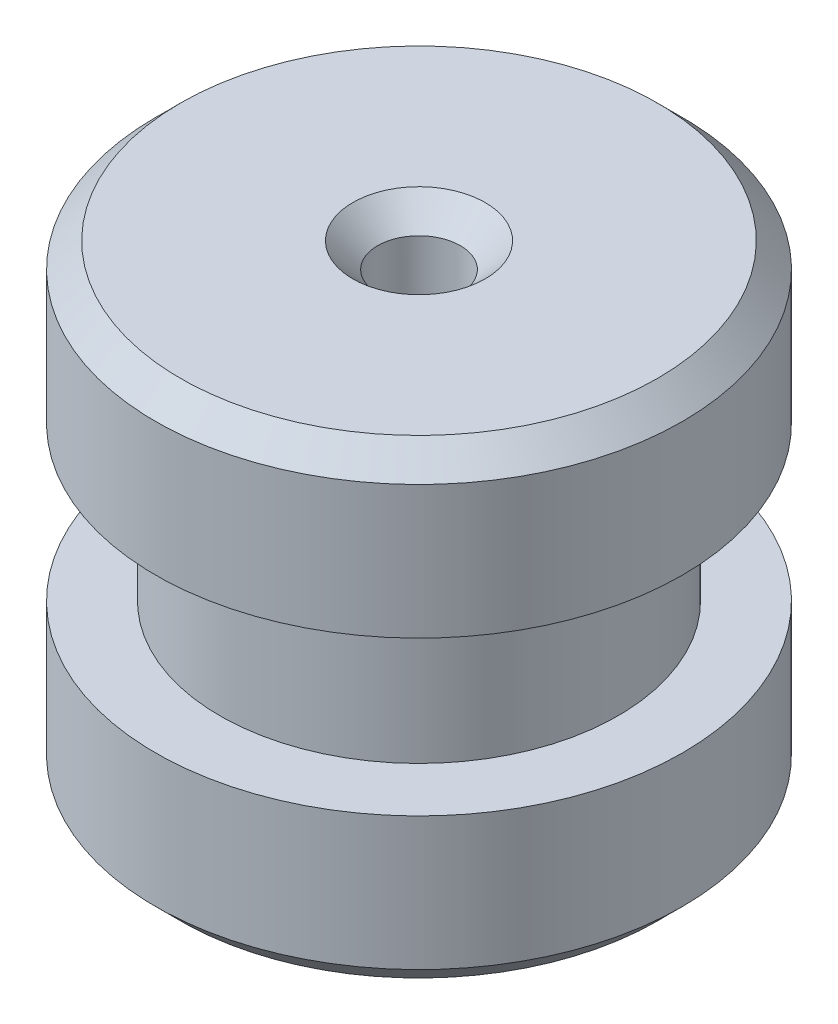
ISO-10303-21;
HEADER;
FILE_DESCRIPTION(('STEP AP214'),'2;1');
FILE_NAME('part.step','',(''),(''),'','','');
FILE_SCHEMA(('AUTOMOTIVE_DESIGN { 1 0 10303 214 1 1 1 1 }'));
ENDSEC;
DATA;
#1=APPLICATION_CONTEXT('core data for automotive mechanical design processes');
#2=APPLICATION_PROTOCOL_DEFINITION('international standard','automotive_design',2000,#1);
#3=PRODUCT_CONTEXT('',#1,'mechanical');
#4=PRODUCT('Part','Part','',(#3));
#5=PRODUCT_RELATED_PRODUCT_CATEGORY('part','',(#4));
#6=PRODUCT_DEFINITION_FORMATION('','',#4);
#7=PRODUCT_DEFINITION_CONTEXT('part definition',#1,'design');
#8=PRODUCT_DEFINITION('design','',#6,#7);
#9=PRODUCT_DEFINITION_SHAPE('','',#8);
#10=(LENGTH_UNIT() NAMED_UNIT(*) SI_UNIT(.MILLI.,.METRE.));
#11=(NAMED_UNIT(*) PLANE_ANGLE_UNIT() SI_UNIT($,.RADIAN.));
#12=(NAMED_UNIT(*) SI_UNIT($,.STERADIAN.) SOLID_ANGLE_UNIT());
#13=UNCERTAINTY_MEASURE_WITH_UNIT(LENGTH_MEASURE(1.E-05),#10,'distance_accuracy_value','');
#14=(GEOMETRIC_REPRESENTATION_CONTEXT(3) GLOBAL_UNCERTAINTY_ASSIGNED_CONTEXT((#13)) GLOBAL_UNIT_ASSIGNED_CONTEXT((#10,
#11,#12)) REPRESENTATION_CONTEXT('',''));
#15=CARTESIAN_POINT('',(0.,0.,0.));
#16=DIRECTION('',(0.,0.,1.));
#17=DIRECTION('',(1.,0.,0.));
#18=AXIS2_PLACEMENT_3D('',#15,#16,#17);
#19=CARTESIAN_POINT('',(0.,0.,0.));
#20=DIRECTION('',(0.,1.,0.));
#21=DIRECTION('',(0.,0.,1.));
#22=AXIS2_PLACEMENT_3D('',#19,#20,#21);
#23=CYLINDRICAL_SURFACE('',#22,1.2446);
#24=CARTESIAN_POINT('',(0.,13.41,0.));
#25=DIRECTION('',(0.,-1.,0.));
#26=DIRECTION('',(0.,0.,-1.));
#27=AXIS2_PLACEMENT_3D('',#24,#25,#26);
#28=CIRCLE('',#27,1.2446);
#29=CARTESIAN_POINT('',(0.,13.41,-1.2446));
#30=VERTEX_POINT('',#29);
#31=EDGE_CURVE('E67',#30,#30,#28,.F.);
#32=ORIENTED_EDGE('',*,*,#31,.T.);
#33=EDGE_LOOP('',(#32));
#34=FACE_BOUND('',#33,.T.);
#35=CARTESIAN_POINT('',(0.,6.00000000000001,0.));
#36=DIRECTION('',(0.,-1.,0.));
#37=DIRECTION('',(1.,0.,0.));
#38=AXIS2_PLACEMENT_3D('',#35,#36,#37);
#39=CIRCLE('',#38,1.2446);
#40=CARTESIAN_POINT('',(1.24460000000001,6.00000000000001,0.));
#41=VERTEX_POINT('',#40);
#42=EDGE_CURVE('E87',#41,#41,#39,.F.);
#43=ORIENTED_EDGE('',*,*,#42,.F.);
#44=EDGE_LOOP('',(#43));
#45=FACE_BOUND('',#44,.T.);
#46=ADVANCED_FACE('F53',(#34,#45),#23,.F.);
#47=CARTESIAN_POINT('',(7.93750000000003,14.1599999999997,0.));
#48=DIRECTION('',(0.,-1.,0.));
#49=DIRECTION('',(1.,0.,0.));
#50=AXIS2_PLACEMENT_3D('',#47,#48,#49);
#51=PLANE('',#50);
#52=CARTESIAN_POINT('',(0.,14.16,0.));
#53=DIRECTION('',(0.,-1.,0.));
#54=DIRECTION('',(1.,0.,0.));
#55=AXIS2_PLACEMENT_3D('',#52,#53,#54);
#56=CIRCLE('',#55,7.18750000000001);
#57=CARTESIAN_POINT('',(7.1875,14.16,0.));
#58=VERTEX_POINT('',#57);
#59=EDGE_CURVE('E78',#58,#58,#56,.F.);
#60=ORIENTED_EDGE('',*,*,#59,.T.);
#61=EDGE_LOOP('',(#60));
#62=FACE_BOUND('',#61,.T.);
#63=CARTESIAN_POINT('',(0.,14.16,0.));
#64=DIRECTION('',(0.,-1.,0.));
#65=DIRECTION('',(1.,0.,0.));
#66=AXIS2_PLACEMENT_3D('',#63,#64,#65);
#67=CIRCLE('',#66,1.9946);
#68=CARTESIAN_POINT('',(1.9946,14.16,0.));
#69=VERTEX_POINT('',#68);
#70=EDGE_CURVE('E82',#69,#69,#67,.T.);
#71=ORIENTED_EDGE('',*,*,#70,.T.);
#72=EDGE_LOOP('',(#71));
#73=FACE_BOUND('',#72,.T.);
#74=ADVANCED_FACE('F127',(#62,#73),#51,.F.);
#75=CARTESIAN_POINT('',(0.,0.,0.));
#76=DIRECTION('',(0.,1.,0.));
#77=DIRECTION('',(-1.,0.,0.));
#78=AXIS2_PLACEMENT_3D('',#75,#76,#77);
#79=PLANE('',#78);
#80=CARTESIAN_POINT('',(0.,0.,0.));
#81=DIRECTION('',(0.,1.,0.));
#82=DIRECTION('',(-1.,0.,0.));
#83=AXIS2_PLACEMENT_3D('',#80,#81,#82);
#84=CIRCLE('',#83,7.1875);
#85=CARTESIAN_POINT('',(-7.18749999999999,0.,0.));
#86=VERTEX_POINT('',#85);
#87=EDGE_CURVE('E12',#86,#86,#84,.F.);
#88=ORIENTED_EDGE('',*,*,#87,.T.);
#89=EDGE_LOOP('',(#88));
#90=FACE_BOUND('',#89,.T.);
#91=CARTESIAN_POINT('',(0.,0.,0.));
#92=DIRECTION('',(0.,-1.,0.));
#93=DIRECTION('',(1.,0.,0.));
#94=AXIS2_PLACEMENT_3D('',#91,#92,#93);
#95=CIRCLE('',#94,2.5);
#96=CARTESIAN_POINT('',(2.5,0.,0.));
#97=VERTEX_POINT('',#96);
#98=EDGE_CURVE('E107',#97,#97,#95,.T.);
#99=ORIENTED_EDGE('',*,*,#98,.F.);
#100=EDGE_LOOP('',(#99));
#101=FACE_BOUND('',#100,.T.);
#102=ADVANCED_FACE('F124',(#90,#101),#79,.F.);
#103=CARTESIAN_POINT('',(0.,14.16,0.));
#104=DIRECTION('',(0.,1.,0.));
#105=DIRECTION('',(-1.,0.,0.));
#106=AXIS2_PLACEMENT_3D('',#103,#104,#105);
#107=CYLINDRICAL_SURFACE('',#106,7.9375);
#108=CARTESIAN_POINT('',(0.,0.750000000000035,0.));
#109=DIRECTION('',(0.,1.,0.));
#110=DIRECTION('',(-1.,0.,0.));
#111=AXIS2_PLACEMENT_3D('',#108,#109,#110);
#112=CIRCLE('',#111,7.9375);
#113=CARTESIAN_POINT('',(-7.93749999999998,0.750000000000037,0.));
#114=VERTEX_POINT('',#113);
#115=EDGE_CURVE('E61',#114,#114,#112,.T.);
#116=ORIENTED_EDGE('',*,*,#115,.T.);
#117=EDGE_LOOP('',(#116));
#118=FACE_BOUND('',#117,.T.);
#119=CARTESIAN_POINT('',(0.,4.75999999999999,0.));
#120=DIRECTION('',(0.,1.,0.));
#121=DIRECTION('',(-1.,0.,0.));
#122=AXIS2_PLACEMENT_3D('',#119,#120,#121);
#123=CIRCLE('',#122,7.9375);
#124=CARTESIAN_POINT('',(-7.93749999999998,4.75999999999999,0.));
#125=VERTEX_POINT('',#124);
#126=EDGE_CURVE('E86',#125,#125,#123,.T.);
#127=ORIENTED_EDGE('',*,*,#126,.F.);
#128=EDGE_LOOP('',(#127));
#129=FACE_BOUND('',#128,.T.);
#130=ADVANCED_FACE('F126',(#118,#129),#107,.T.);
#131=CARTESIAN_POINT('',(7.9375,4.75999999999966,0.));
#132=DIRECTION('',(0.,-1.,0.));
#133=DIRECTION('',(1.,0.,0.));
#134=AXIS2_PLACEMENT_3D('',#131,#132,#133);
#135=PLANE('',#134);
#136=CARTESIAN_POINT('',(0.,4.75999999999999,0.));
#137=DIRECTION('',(0.,1.,0.));
#138=DIRECTION('',(-1.,0.,0.));
#139=AXIS2_PLACEMENT_3D('',#136,#137,#138);
#140=CIRCLE('',#139,6.);
#141=CARTESIAN_POINT('',(-5.99999999999998,4.75999999999999,0.));
#142=VERTEX_POINT('',#141);
#143=EDGE_CURVE('E96',#142,#142,#140,.T.);
#144=ORIENTED_EDGE('',*,*,#143,.F.);
#145=EDGE_LOOP('',(#144));
#146=FACE_BOUND('',#145,.T.);
#147=ORIENTED_EDGE('',*,*,#126,.T.);
#148=EDGE_LOOP('',(#147));
#149=FACE_BOUND('',#148,.T.);
#150=ADVANCED_FACE('F133',(#146,#149),#135,.F.);
#151=CARTESIAN_POINT('',(0.,14.16,0.));
#152=DIRECTION('',(0.,1.,0.));
#153=DIRECTION('',(-1.,0.,0.));
#154=AXIS2_PLACEMENT_3D('',#151,#152,#153);
#155=CYLINDRICAL_SURFACE('',#154,6.);
#156=CARTESIAN_POINT('',(0.,9.39999999999997,-1.11022302462516E-13));
#157=DIRECTION('',(0.,1.,0.));
#158=DIRECTION('',(-1.,0.,0.));
#159=AXIS2_PLACEMENT_3D('',#156,#157,#158);
#160=CIRCLE('',#159,6.);
#161=CARTESIAN_POINT('',(-5.99999999999998,9.39999999999997,-1.11022302462516E-13));
#162=VERTEX_POINT('',#161);
#163=EDGE_CURVE('E100',#162,#162,#160,.T.);
#164=ORIENTED_EDGE('',*,*,#163,.F.);
#165=EDGE_LOOP('',(#164));
#166=FACE_BOUND('',#165,.T.);
#167=ORIENTED_EDGE('',*,*,#143,.T.);
#168=EDGE_LOOP('',(#167));
#169=FACE_BOUND('',#168,.T.);
#170=ADVANCED_FACE('F152',(#166,#169),#155,.T.);
#171=CARTESIAN_POINT('',(6.00000000000002,9.40000000000008,0.));
#172=DIRECTION('',(0.,1.,0.));
#173=DIRECTION('',(-1.,0.,0.));
#174=AXIS2_PLACEMENT_3D('',#171,#172,#173);
#175=PLANE('',#174);
#176=CARTESIAN_POINT('',(0.,9.39999999999997,-1.11022302462516E-13));
#177=DIRECTION('',(0.,1.,0.));
#178=DIRECTION('',(-1.,0.,0.));
#179=AXIS2_PLACEMENT_3D('',#176,#177,#178);
#180=CIRCLE('',#179,7.9375);
#181=CARTESIAN_POINT('',(-7.93749999999998,9.39999999999997,-1.11022302462516E-13));
#182=VERTEX_POINT('',#181);
#183=EDGE_CURVE('E91',#182,#182,#180,.T.);
#184=ORIENTED_EDGE('',*,*,#183,.F.);
#185=EDGE_LOOP('',(#184));
#186=FACE_BOUND('',#185,.T.);
#187=ORIENTED_EDGE('',*,*,#163,.T.);
#188=EDGE_LOOP('',(#187));
#189=FACE_BOUND('',#188,.T.);
#190=ADVANCED_FACE('F148',(#186,#189),#175,.F.);
#191=CARTESIAN_POINT('',(0.,14.16,0.));
#192=DIRECTION('',(0.,1.,0.));
#193=DIRECTION('',(-1.,0.,0.));
#194=AXIS2_PLACEMENT_3D('',#191,#192,#193);
#195=CYLINDRICAL_SURFACE('',#194,7.9375);
#196=CARTESIAN_POINT('',(0.,13.41,0.));
#197=DIRECTION('',(0.,-1.,0.));
#198=DIRECTION('',(1.,0.,0.));
#199=AXIS2_PLACEMENT_3D('',#196,#197,#198);
#200=CIRCLE('',#199,7.9375);
#201=CARTESIAN_POINT('',(7.93749999999997,13.41,0.));
#202=VERTEX_POINT('',#201);
#203=EDGE_CURVE('E72',#202,#202,#200,.T.);
#204=ORIENTED_EDGE('',*,*,#203,.T.);
#205=EDGE_LOOP('',(#204));
#206=FACE_BOUND('',#205,.T.);
#207=ORIENTED_EDGE('',*,*,#183,.T.);
#208=EDGE_LOOP('',(#207));
#209=FACE_BOUND('',#208,.T.);
#210=ADVANCED_FACE('F145',(#206,#209),#195,.T.);
#211=CARTESIAN_POINT('',(0.,6.00000000000001,-1.11022302462516E-13));
#212=DIRECTION('',(0.,-1.,0.));
#213=DIRECTION('',(1.,0.,0.));
#214=AXIS2_PLACEMENT_3D('',#211,#212,#213);
#215=PLANE('',#214);
#216=CARTESIAN_POINT('',(0.,6.00000000000001,-1.11022302462516E-13));
#217=DIRECTION('',(0.,-1.,0.));
#218=DIRECTION('',(1.,0.,0.));
#219=AXIS2_PLACEMENT_3D('',#216,#217,#218);
#220=CIRCLE('',#219,2.5);
#221=CARTESIAN_POINT('',(2.49999999999997,6.00000000000001,-1.11022302462516E-13));
#222=VERTEX_POINT('',#221);
#223=EDGE_CURVE('E92',#222,#222,#220,.T.);
#224=ORIENTED_EDGE('',*,*,#223,.T.);
#225=EDGE_LOOP('',(#224));
#226=FACE_BOUND('',#225,.T.);
#227=ORIENTED_EDGE('',*,*,#42,.T.);
#228=EDGE_LOOP('',(#227));
#229=FACE_BOUND('',#228,.T.);
#230=ADVANCED_FACE('F114',(#226,#229),#215,.T.);
#231=CARTESIAN_POINT('',(0.,6.00000000000001,-1.11022302462516E-13));
#232=DIRECTION('',(0.,-1.,0.));
#233=DIRECTION('',(1.,0.,0.));
#234=AXIS2_PLACEMENT_3D('',#231,#232,#233);
#235=CYLINDRICAL_SURFACE('',#234,2.5);
#236=ORIENTED_EDGE('',*,*,#223,.F.);
#237=EDGE_LOOP('',(#236));
#238=FACE_BOUND('',#237,.T.);
#239=ORIENTED_EDGE('',*,*,#98,.T.);
#240=EDGE_LOOP('',(#239));
#241=FACE_BOUND('',#240,.T.);
#242=ADVANCED_FACE('F117',(#238,#241),#235,.F.);
#243=CARTESIAN_POINT('',(0.,14.16,0.));
#244=DIRECTION('',(0.,-1.,0.));
#245=DIRECTION('',(1.,0.,0.));
#246=AXIS2_PLACEMENT_3D('',#243,#244,#245);
#247=CONICAL_SURFACE('',#246,7.1875,0.785398163397445);
#248=ORIENTED_EDGE('',*,*,#203,.F.);
#249=EDGE_LOOP('',(#248));
#250=FACE_BOUND('',#249,.T.);
#251=ORIENTED_EDGE('',*,*,#59,.F.);
#252=EDGE_LOOP('',(#251));
#253=FACE_BOUND('',#252,.T.);
#254=ADVANCED_FACE('F120',(#250,#253),#247,.T.);
#255=CARTESIAN_POINT('',(0.,13.41,0.));
#256=DIRECTION('',(0.,1.,0.));
#257=DIRECTION('',(0.,0.,1.));
#258=AXIS2_PLACEMENT_3D('',#255,#256,#257);
#259=CONICAL_SURFACE('',#258,1.2446,0.785398163397451);
#260=ORIENTED_EDGE('',*,*,#70,.F.);
#261=EDGE_LOOP('',(#260));
#262=FACE_BOUND('',#261,.T.);
#263=ORIENTED_EDGE('',*,*,#31,.F.);
#264=EDGE_LOOP('',(#263));
#265=FACE_BOUND('',#264,.T.);
#266=ADVANCED_FACE('F193',(#262,#265),#259,.F.);
#267=CARTESIAN_POINT('',(0.,0.750000000000035,0.));
#268=DIRECTION('',(0.,1.,0.));
#269=DIRECTION('',(-1.,0.,0.));
#270=AXIS2_PLACEMENT_3D('',#267,#268,#269);
#271=CONICAL_SURFACE('',#270,7.9375,0.785398163397449);
#272=ORIENTED_EDGE('',*,*,#87,.F.);
#273=EDGE_LOOP('',(#272));
#274=FACE_BOUND('',#273,.T.);
#275=ORIENTED_EDGE('',*,*,#115,.F.);
#276=EDGE_LOOP('',(#275));
#277=FACE_BOUND('',#276,.T.);
#278=ADVANCED_FACE('F55',(#274,#277),#271,.T.);
#279=CLOSED_SHELL('',(#46,#74,#102,#130,#150,#170,#190,#210,#230,#242,#254,#266,#278));
#280=MANIFOLD_SOLID_BREP('B2',#279);
#281=ADVANCED_BREP_SHAPE_REPRESENTATION('',(#18,#280),#14);
#282=SHAPE_DEFINITION_REPRESENTATION(#9,#281);
ENDSEC;
END-ISO-10303-21;
